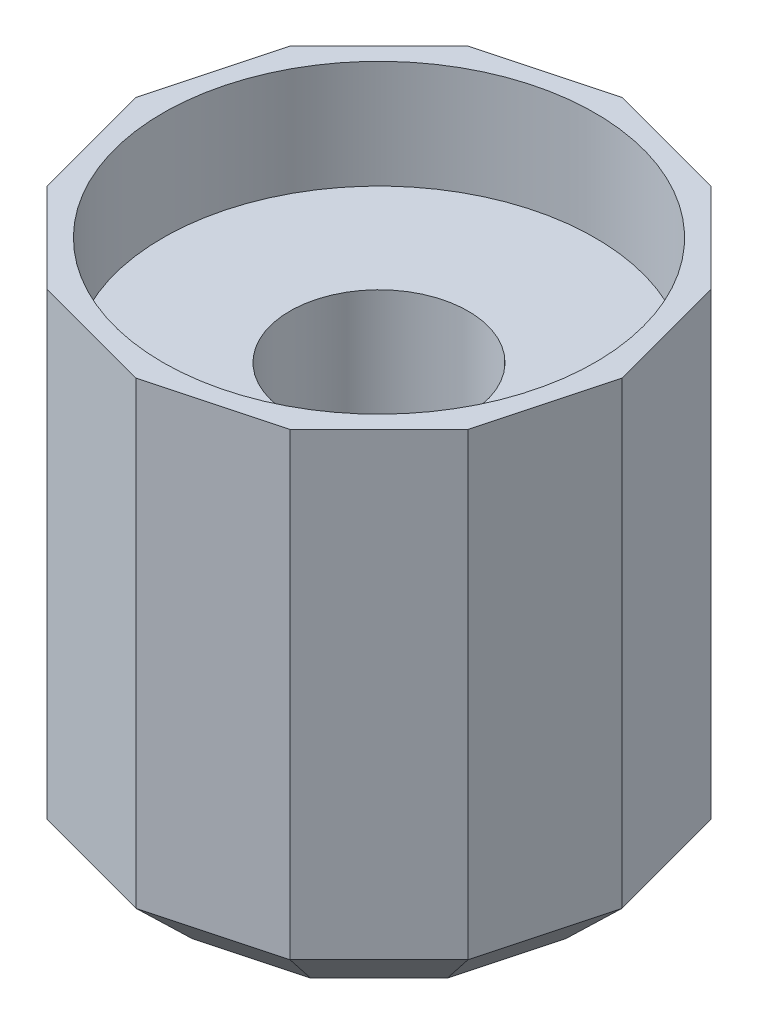
ISO-10303-21;
HEADER;
FILE_DESCRIPTION(('STEP AP214'),'2;1');
FILE_NAME('part.step','',(''),(''),'','','');
FILE_SCHEMA(('AUTOMOTIVE_DESIGN { 1 0 10303 214 1 1 1 1 }'));
ENDSEC;
DATA;
#1=APPLICATION_CONTEXT('core data for automotive mechanical design processes');
#2=APPLICATION_PROTOCOL_DEFINITION('international standard','automotive_design',2000,#1);
#3=PRODUCT_CONTEXT('',#1,'mechanical');
#4=PRODUCT('Part','Part','',(#3));
#5=PRODUCT_RELATED_PRODUCT_CATEGORY('part','',(#4));
#6=PRODUCT_DEFINITION_FORMATION('','',#4);
#7=PRODUCT_DEFINITION_CONTEXT('part definition',#1,'design');
#8=PRODUCT_DEFINITION('design','',#6,#7);
#9=PRODUCT_DEFINITION_SHAPE('','',#8);
#10=(LENGTH_UNIT() NAMED_UNIT(*) SI_UNIT(.MILLI.,.METRE.));
#11=(NAMED_UNIT(*) PLANE_ANGLE_UNIT() SI_UNIT($,.RADIAN.));
#12=(NAMED_UNIT(*) SI_UNIT($,.STERADIAN.) SOLID_ANGLE_UNIT());
#13=UNCERTAINTY_MEASURE_WITH_UNIT(LENGTH_MEASURE(1.E-05),#10,'distance_accuracy_value','');
#14=(GEOMETRIC_REPRESENTATION_CONTEXT(3) GLOBAL_UNCERTAINTY_ASSIGNED_CONTEXT((#13)) GLOBAL_UNIT_ASSIGNED_CONTEXT((#10,
#11,#12)) REPRESENTATION_CONTEXT('',''));
#15=CARTESIAN_POINT('',(0.,0.,0.));
#16=DIRECTION('',(0.,0.,1.));
#17=DIRECTION('',(1.,0.,0.));
#18=AXIS2_PLACEMENT_3D('',#15,#16,#17);
#19=CARTESIAN_POINT('',(4.49999999999993,19.,-7.79422863406));
#20=DIRECTION('',(-0.25881904510251,0.,0.965925826289071));
#21=DIRECTION('',(0.965925826289071,0.,0.25881904510251));
#22=AXIS2_PLACEMENT_3D('',#19,#20,#21);
#23=PLANE('',#22);
#24=DIRECTION('',(0.,-1.,0.));
#25=VECTOR('',#24,1.);
#26=CARTESIAN_POINT('',(4.49999999999993,19.,-7.79422863406));
#27=LINE('',#26,#25);
#28=CARTESIAN_POINT('',(4.49999999999993,19.,-7.79422863406));
#29=VERTEX_POINT('',#28);
#30=CARTESIAN_POINT('',(4.49999999999993,2.00000000000001,-7.79422863406));
#31=VERTEX_POINT('',#30);
#32=EDGE_CURVE('E372',#29,#31,#27,.T.);
#33=ORIENTED_EDGE('',*,*,#32,.T.);
#34=DIRECTION('',(-0.965925826289071,0.,-0.25881904510251));
#35=VECTOR('',#34,1.);
#36=CARTESIAN_POINT('',(4.49999999999993,2.00000000000001,-7.79422863406));
#37=LINE('',#36,#35);
#38=CARTESIAN_POINT('',(-1.01481323344643E-13,2.00000000000001,-9.));
#39=VERTEX_POINT('',#38);
#40=EDGE_CURVE('E201',#31,#39,#37,.T.);
#41=ORIENTED_EDGE('',*,*,#40,.T.);
#42=DIRECTION('',(0.,-1.,0.));
#43=VECTOR('',#42,1.);
#44=CARTESIAN_POINT('',(-1.01481323344643E-13,19.,-9.));
#45=LINE('',#44,#43);
#46=CARTESIAN_POINT('',(-1.01481323344643E-13,19.,-9.));
#47=VERTEX_POINT('',#46);
#48=EDGE_CURVE('E181',#47,#39,#45,.T.);
#49=ORIENTED_EDGE('',*,*,#48,.F.);
#50=DIRECTION('',(-0.965925826289071,0.,-0.25881904510251));
#51=VECTOR('',#50,1.);
#52=CARTESIAN_POINT('',(4.49999999999993,19.,-7.79422863406));
#53=LINE('',#52,#51);
#54=EDGE_CURVE('E188',#29,#47,#53,.T.);
#55=ORIENTED_EDGE('',*,*,#54,.F.);
#56=EDGE_LOOP('',(#33,#41,#49,#55));
#57=FACE_BOUND('',#56,.T.);
#58=ADVANCED_FACE('F47',(#57),#23,.F.);
#59=CARTESIAN_POINT('',(-1.01481323344643E-13,19.,-9.));
#60=DIRECTION('',(0.25881904510253,0.,0.965925826289066));
#61=DIRECTION('',(0.965925826289066,0.,-0.25881904510253));
#62=AXIS2_PLACEMENT_3D('',#59,#60,#61);
#63=PLANE('',#62);
#64=ORIENTED_EDGE('',*,*,#48,.T.);
#65=DIRECTION('',(-0.965925826289066,0.,0.25881904510253));
#66=VECTOR('',#65,1.);
#67=CARTESIAN_POINT('',(-1.01481323344643E-13,2.00000000000001,-9.));
#68=LINE('',#67,#66);
#69=CARTESIAN_POINT('',(-4.50000000000008,2.00000000000001,-7.79422863405991));
#70=VERTEX_POINT('',#69);
#71=EDGE_CURVE('E270',#39,#70,#68,.T.);
#72=ORIENTED_EDGE('',*,*,#71,.T.);
#73=DIRECTION('',(0.,-1.,0.));
#74=VECTOR('',#73,1.);
#75=CARTESIAN_POINT('',(-4.50000000000008,19.,-7.79422863405991));
#76=LINE('',#75,#74);
#77=CARTESIAN_POINT('',(-4.50000000000008,19.,-7.79422863405991));
#78=VERTEX_POINT('',#77);
#79=EDGE_CURVE('E183',#78,#70,#76,.T.);
#80=ORIENTED_EDGE('',*,*,#79,.F.);
#81=DIRECTION('',(-0.965925826289066,0.,0.25881904510253));
#82=VECTOR('',#81,1.);
#83=CARTESIAN_POINT('',(-1.01481323344643E-13,19.,-9.));
#84=LINE('',#83,#82);
#85=EDGE_CURVE('E177',#47,#78,#84,.T.);
#86=ORIENTED_EDGE('',*,*,#85,.F.);
#87=EDGE_LOOP('',(#64,#72,#80,#86));
#88=FACE_BOUND('',#87,.T.);
#89=ADVANCED_FACE('F179',(#88),#63,.F.);
#90=CARTESIAN_POINT('',(-4.50000000000008,19.,-7.79422863405991));
#91=DIRECTION('',(0.707106781186555,0.,0.70710678118654));
#92=DIRECTION('',(0.70710678118654,0.,-0.707106781186555));
#93=AXIS2_PLACEMENT_3D('',#90,#91,#92);
#94=PLANE('',#93);
#95=ORIENTED_EDGE('',*,*,#79,.T.);
#96=DIRECTION('',(-0.70710678118654,0.,0.707106781186555));
#97=VECTOR('',#96,1.);
#98=CARTESIAN_POINT('',(-4.50000000000008,2.00000000000001,-7.79422863405991));
#99=LINE('',#98,#97);
#100=CARTESIAN_POINT('',(-7.79422863406,2.00000000000001,-4.49999999999992));
#101=VERTEX_POINT('',#100);
#102=EDGE_CURVE('E73',#70,#101,#99,.T.);
#103=ORIENTED_EDGE('',*,*,#102,.T.);
#104=DIRECTION('',(0.,-1.,0.));
#105=VECTOR('',#104,1.);
#106=CARTESIAN_POINT('',(-7.79422863406,19.,-4.49999999999992));
#107=LINE('',#106,#105);
#108=CARTESIAN_POINT('',(-7.79422863406,19.,-4.49999999999992));
#109=VERTEX_POINT('',#108);
#110=EDGE_CURVE('E210',#109,#101,#107,.T.);
#111=ORIENTED_EDGE('',*,*,#110,.F.);
#112=DIRECTION('',(-0.70710678118654,0.,0.707106781186555));
#113=VECTOR('',#112,1.);
#114=CARTESIAN_POINT('',(-4.50000000000008,19.,-7.79422863405991));
#115=LINE('',#114,#113);
#116=EDGE_CURVE('E187',#78,#109,#115,.T.);
#117=ORIENTED_EDGE('',*,*,#116,.F.);
#118=EDGE_LOOP('',(#95,#103,#111,#117));
#119=FACE_BOUND('',#118,.T.);
#120=ADVANCED_FACE('F432',(#119),#94,.F.);
#121=CARTESIAN_POINT('',(-7.79422863406,19.,-4.49999999999992));
#122=DIRECTION('',(0.965925826289071,0.,0.258819045102509));
#123=DIRECTION('',(0.258819045102509,0.,-0.965925826289071));
#124=AXIS2_PLACEMENT_3D('',#121,#122,#123);
#125=PLANE('',#124);
#126=ORIENTED_EDGE('',*,*,#110,.T.);
#127=DIRECTION('',(-0.258819045102509,0.,0.965925826289071));
#128=VECTOR('',#127,1.);
#129=CARTESIAN_POINT('',(-7.79422863406,2.00000000000001,-4.49999999999992));
#130=LINE('',#129,#128);
#131=CARTESIAN_POINT('',(-9.,2.00000000000001,1.0321604682062E-13));
#132=VERTEX_POINT('',#131);
#133=EDGE_CURVE('E58',#101,#132,#130,.T.);
#134=ORIENTED_EDGE('',*,*,#133,.T.);
#135=DIRECTION('',(0.,-1.,0.));
#136=VECTOR('',#135,1.);
#137=CARTESIAN_POINT('',(-9.,19.,1.0321604682062E-13));
#138=LINE('',#137,#136);
#139=CARTESIAN_POINT('',(-9.,19.,1.0321604682062E-13));
#140=VERTEX_POINT('',#139);
#141=EDGE_CURVE('E403',#140,#132,#138,.T.);
#142=ORIENTED_EDGE('',*,*,#141,.F.);
#143=DIRECTION('',(-0.258819045102509,0.,0.965925826289071));
#144=VECTOR('',#143,1.);
#145=CARTESIAN_POINT('',(-7.79422863406,19.,-4.49999999999992));
#146=LINE('',#145,#144);
#147=EDGE_CURVE('E346',#109,#140,#146,.T.);
#148=ORIENTED_EDGE('',*,*,#147,.F.);
#149=EDGE_LOOP('',(#126,#134,#142,#148));
#150=FACE_BOUND('',#149,.T.);
#151=ADVANCED_FACE('F408',(#150),#125,.F.);
#152=CARTESIAN_POINT('',(-9.,19.,1.0321604682062E-13));
#153=DIRECTION('',(0.965925826289066,0.,-0.25881904510253));
#154=DIRECTION('',(-0.25881904510253,0.,-0.965925826289066));
#155=AXIS2_PLACEMENT_3D('',#152,#153,#154);
#156=PLANE('',#155);
#157=ORIENTED_EDGE('',*,*,#141,.T.);
#158=DIRECTION('',(0.25881904510253,0.,0.965925826289066));
#159=VECTOR('',#158,1.);
#160=CARTESIAN_POINT('',(-9.,2.00000000000001,1.0321604682062E-13));
#161=LINE('',#160,#159);
#162=CARTESIAN_POINT('',(-7.7942286340599,2.00000000000001,4.50000000000008));
#163=VERTEX_POINT('',#162);
#164=EDGE_CURVE('E11',#132,#163,#161,.T.);
#165=ORIENTED_EDGE('',*,*,#164,.T.);
#166=DIRECTION('',(0.,-1.,0.));
#167=VECTOR('',#166,1.);
#168=CARTESIAN_POINT('',(-7.7942286340599,19.,4.50000000000008));
#169=LINE('',#168,#167);
#170=CARTESIAN_POINT('',(-7.7942286340599,19.,4.50000000000008));
#171=VERTEX_POINT('',#170);
#172=EDGE_CURVE('E399',#171,#163,#169,.T.);
#173=ORIENTED_EDGE('',*,*,#172,.F.);
#174=DIRECTION('',(0.25881904510253,0.,0.965925826289066));
#175=VECTOR('',#174,1.);
#176=CARTESIAN_POINT('',(-9.,19.,1.0321604682062E-13));
#177=LINE('',#176,#175);
#178=EDGE_CURVE('E349',#140,#171,#177,.T.);
#179=ORIENTED_EDGE('',*,*,#178,.F.);
#180=EDGE_LOOP('',(#157,#165,#173,#179));
#181=FACE_BOUND('',#180,.T.);
#182=ADVANCED_FACE('F424',(#181),#156,.F.);
#183=CARTESIAN_POINT('',(-7.7942286340599,19.,4.50000000000008));
#184=DIRECTION('',(0.70710678118654,0.,-0.707106781186555));
#185=DIRECTION('',(-0.707106781186555,0.,-0.70710678118654));
#186=AXIS2_PLACEMENT_3D('',#183,#184,#185);
#187=PLANE('',#186);
#188=ORIENTED_EDGE('',*,*,#172,.T.);
#189=DIRECTION('',(0.707106781186555,0.,0.70710678118654));
#190=VECTOR('',#189,1.);
#191=CARTESIAN_POINT('',(-7.7942286340599,2.00000000000001,4.50000000000008));
#192=LINE('',#191,#190);
#193=CARTESIAN_POINT('',(-4.49999999999992,2.00000000000001,7.79422863406));
#194=VERTEX_POINT('',#193);
#195=EDGE_CURVE('E203',#163,#194,#192,.T.);
#196=ORIENTED_EDGE('',*,*,#195,.T.);
#197=DIRECTION('',(0.,-1.,0.));
#198=VECTOR('',#197,1.);
#199=CARTESIAN_POINT('',(-4.49999999999992,19.,7.79422863406));
#200=LINE('',#199,#198);
#201=CARTESIAN_POINT('',(-4.49999999999992,19.,7.79422863406));
#202=VERTEX_POINT('',#201);
#203=EDGE_CURVE('E395',#202,#194,#200,.T.);
#204=ORIENTED_EDGE('',*,*,#203,.F.);
#205=DIRECTION('',(0.707106781186555,0.,0.70710678118654));
#206=VECTOR('',#205,1.);
#207=CARTESIAN_POINT('',(-7.7942286340599,19.,4.50000000000008));
#208=LINE('',#207,#206);
#209=EDGE_CURVE('E352',#171,#202,#208,.T.);
#210=ORIENTED_EDGE('',*,*,#209,.F.);
#211=EDGE_LOOP('',(#188,#196,#204,#210));
#212=FACE_BOUND('',#211,.T.);
#213=ADVANCED_FACE('F428',(#212),#187,.F.);
#214=CARTESIAN_POINT('',(-4.49999999999992,19.,7.79422863406));
#215=DIRECTION('',(0.25881904510251,0.,-0.965925826289071));
#216=DIRECTION('',(-0.965925826289071,0.,-0.25881904510251));
#217=AXIS2_PLACEMENT_3D('',#214,#215,#216);
#218=PLANE('',#217);
#219=ORIENTED_EDGE('',*,*,#203,.T.);
#220=DIRECTION('',(0.965925826289071,0.,0.25881904510251));
#221=VECTOR('',#220,1.);
#222=CARTESIAN_POINT('',(-4.49999999999992,2.00000000000001,7.79422863406));
#223=LINE('',#222,#221);
#224=CARTESIAN_POINT('',(0.,2.00000000000001,9.));
#225=VERTEX_POINT('',#224);
#226=EDGE_CURVE('E250',#194,#225,#223,.T.);
#227=ORIENTED_EDGE('',*,*,#226,.T.);
#228=DIRECTION('',(0.,-1.,0.));
#229=VECTOR('',#228,1.);
#230=CARTESIAN_POINT('',(0.,19.,9.));
#231=LINE('',#230,#229);
#232=CARTESIAN_POINT('',(0.,19.,9.));
#233=VERTEX_POINT('',#232);
#234=EDGE_CURVE('E391',#233,#225,#231,.T.);
#235=ORIENTED_EDGE('',*,*,#234,.F.);
#236=DIRECTION('',(0.965925826289071,0.,0.25881904510251));
#237=VECTOR('',#236,1.);
#238=CARTESIAN_POINT('',(-4.49999999999992,19.,7.79422863406));
#239=LINE('',#238,#237);
#240=EDGE_CURVE('E355',#202,#233,#239,.T.);
#241=ORIENTED_EDGE('',*,*,#240,.F.);
#242=EDGE_LOOP('',(#219,#227,#235,#241));
#243=FACE_BOUND('',#242,.T.);
#244=ADVANCED_FACE('F682',(#243),#218,.F.);
#245=CARTESIAN_POINT('',(0.,19.,9.));
#246=DIRECTION('',(-0.25881904510253,0.,-0.965925826289066));
#247=DIRECTION('',(-0.965925826289066,0.,0.25881904510253));
#248=AXIS2_PLACEMENT_3D('',#245,#246,#247);
#249=PLANE('',#248);
#250=ORIENTED_EDGE('',*,*,#234,.T.);
#251=DIRECTION('',(0.965925826289066,0.,-0.25881904510253));
#252=VECTOR('',#251,1.);
#253=CARTESIAN_POINT('',(0.,2.00000000000001,9.));
#254=LINE('',#253,#252);
#255=CARTESIAN_POINT('',(4.50000000000008,2.00000000000001,7.7942286340599));
#256=VERTEX_POINT('',#255);
#257=EDGE_CURVE('E253',#225,#256,#254,.T.);
#258=ORIENTED_EDGE('',*,*,#257,.T.);
#259=DIRECTION('',(0.,-1.,0.));
#260=VECTOR('',#259,1.);
#261=CARTESIAN_POINT('',(4.50000000000008,19.,7.7942286340599));
#262=LINE('',#261,#260);
#263=CARTESIAN_POINT('',(4.50000000000008,19.,7.7942286340599));
#264=VERTEX_POINT('',#263);
#265=EDGE_CURVE('E387',#264,#256,#262,.T.);
#266=ORIENTED_EDGE('',*,*,#265,.F.);
#267=DIRECTION('',(0.965925826289066,0.,-0.25881904510253));
#268=VECTOR('',#267,1.);
#269=CARTESIAN_POINT('',(0.,19.,9.));
#270=LINE('',#269,#268);
#271=EDGE_CURVE('E358',#233,#264,#270,.T.);
#272=ORIENTED_EDGE('',*,*,#271,.F.);
#273=EDGE_LOOP('',(#250,#258,#266,#272));
#274=FACE_BOUND('',#273,.T.);
#275=ADVANCED_FACE('F673',(#274),#249,.F.);
#276=CARTESIAN_POINT('',(4.50000000000008,19.,7.7942286340599));
#277=DIRECTION('',(-0.707106781186555,0.,-0.70710678118654));
#278=DIRECTION('',(-0.70710678118654,0.,0.707106781186555));
#279=AXIS2_PLACEMENT_3D('',#276,#277,#278);
#280=PLANE('',#279);
#281=ORIENTED_EDGE('',*,*,#265,.T.);
#282=DIRECTION('',(0.70710678118654,0.,-0.707106781186555));
#283=VECTOR('',#282,1.);
#284=CARTESIAN_POINT('',(4.50000000000008,2.00000000000001,7.7942286340599));
#285=LINE('',#284,#283);
#286=CARTESIAN_POINT('',(7.79422863406,2.00000000000001,4.49999999999992));
#287=VERTEX_POINT('',#286);
#288=EDGE_CURVE('E256',#256,#287,#285,.T.);
#289=ORIENTED_EDGE('',*,*,#288,.T.);
#290=DIRECTION('',(0.,-1.,0.));
#291=VECTOR('',#290,1.);
#292=CARTESIAN_POINT('',(7.79422863406,19.,4.49999999999992));
#293=LINE('',#292,#291);
#294=CARTESIAN_POINT('',(7.79422863406,19.,4.49999999999992));
#295=VERTEX_POINT('',#294);
#296=EDGE_CURVE('E383',#295,#287,#293,.T.);
#297=ORIENTED_EDGE('',*,*,#296,.F.);
#298=DIRECTION('',(0.70710678118654,0.,-0.707106781186555));
#299=VECTOR('',#298,1.);
#300=CARTESIAN_POINT('',(4.50000000000008,19.,7.7942286340599));
#301=LINE('',#300,#299);
#302=EDGE_CURVE('E361',#264,#295,#301,.T.);
#303=ORIENTED_EDGE('',*,*,#302,.F.);
#304=EDGE_LOOP('',(#281,#289,#297,#303));
#305=FACE_BOUND('',#304,.T.);
#306=ADVANCED_FACE('F664',(#305),#280,.F.);
#307=CARTESIAN_POINT('',(7.79422863406,19.,4.49999999999992));
#308=DIRECTION('',(-0.965925826289071,0.,-0.25881904510251));
#309=DIRECTION('',(-0.25881904510251,0.,0.965925826289071));
#310=AXIS2_PLACEMENT_3D('',#307,#308,#309);
#311=PLANE('',#310);
#312=ORIENTED_EDGE('',*,*,#296,.T.);
#313=DIRECTION('',(0.25881904510251,0.,-0.965925826289071));
#314=VECTOR('',#313,1.);
#315=CARTESIAN_POINT('',(7.79422863406,2.00000000000001,4.49999999999992));
#316=LINE('',#315,#314);
#317=CARTESIAN_POINT('',(9.,2.00000000000001,0.));
#318=VERTEX_POINT('',#317);
#319=EDGE_CURVE('E259',#287,#318,#316,.T.);
#320=ORIENTED_EDGE('',*,*,#319,.T.);
#321=DIRECTION('',(0.,-1.,0.));
#322=VECTOR('',#321,1.);
#323=CARTESIAN_POINT('',(9.,19.,0.));
#324=LINE('',#323,#322);
#325=CARTESIAN_POINT('',(9.,19.,0.));
#326=VERTEX_POINT('',#325);
#327=EDGE_CURVE('E379',#326,#318,#324,.T.);
#328=ORIENTED_EDGE('',*,*,#327,.F.);
#329=DIRECTION('',(0.25881904510251,0.,-0.965925826289071));
#330=VECTOR('',#329,1.);
#331=CARTESIAN_POINT('',(7.79422863406,19.,4.49999999999992));
#332=LINE('',#331,#330);
#333=EDGE_CURVE('E364',#295,#326,#332,.T.);
#334=ORIENTED_EDGE('',*,*,#333,.F.);
#335=EDGE_LOOP('',(#312,#320,#328,#334));
#336=FACE_BOUND('',#335,.T.);
#337=ADVANCED_FACE('F655',(#336),#311,.F.);
#338=CARTESIAN_POINT('',(9.,19.,0.));
#339=DIRECTION('',(-0.965925826289066,0.,0.258819045102529));
#340=DIRECTION('',(0.258819045102529,0.,0.965925826289066));
#341=AXIS2_PLACEMENT_3D('',#338,#339,#340);
#342=PLANE('',#341);
#343=ORIENTED_EDGE('',*,*,#327,.T.);
#344=DIRECTION('',(-0.258819045102529,0.,-0.965925826289066));
#345=VECTOR('',#344,1.);
#346=CARTESIAN_POINT('',(9.,2.00000000000001,0.));
#347=LINE('',#346,#345);
#348=CARTESIAN_POINT('',(7.79422863405991,2.00000000000001,-4.50000000000008));
#349=VERTEX_POINT('',#348);
#350=EDGE_CURVE('E262',#318,#349,#347,.T.);
#351=ORIENTED_EDGE('',*,*,#350,.T.);
#352=DIRECTION('',(0.,-1.,0.));
#353=VECTOR('',#352,1.);
#354=CARTESIAN_POINT('',(7.79422863405991,19.,-4.50000000000008));
#355=LINE('',#354,#353);
#356=CARTESIAN_POINT('',(7.79422863405991,19.,-4.50000000000008));
#357=VERTEX_POINT('',#356);
#358=EDGE_CURVE('E375',#357,#349,#355,.T.);
#359=ORIENTED_EDGE('',*,*,#358,.F.);
#360=DIRECTION('',(-0.258819045102529,0.,-0.965925826289066));
#361=VECTOR('',#360,1.);
#362=CARTESIAN_POINT('',(9.,19.,0.));
#363=LINE('',#362,#361);
#364=EDGE_CURVE('E367',#326,#357,#363,.T.);
#365=ORIENTED_EDGE('',*,*,#364,.F.);
#366=EDGE_LOOP('',(#343,#351,#359,#365));
#367=FACE_BOUND('',#366,.T.);
#368=ADVANCED_FACE('F646',(#367),#342,.F.);
#369=CARTESIAN_POINT('',(7.79422863405991,19.,-4.50000000000008));
#370=DIRECTION('',(-0.707106781186541,0.,0.707106781186555));
#371=DIRECTION('',(0.707106781186555,0.,0.707106781186541));
#372=AXIS2_PLACEMENT_3D('',#369,#370,#371);
#373=PLANE('',#372);
#374=ORIENTED_EDGE('',*,*,#358,.T.);
#375=DIRECTION('',(-0.707106781186555,0.,-0.707106781186541));
#376=VECTOR('',#375,1.);
#377=CARTESIAN_POINT('',(7.79422863405991,2.00000000000001,-4.50000000000008));
#378=LINE('',#377,#376);
#379=EDGE_CURVE('E265',#349,#31,#378,.T.);
#380=ORIENTED_EDGE('',*,*,#379,.T.);
#381=ORIENTED_EDGE('',*,*,#32,.F.);
#382=DIRECTION('',(-0.707106781186554,0.,-0.70710678118654));
#383=VECTOR('',#382,1.);
#384=CARTESIAN_POINT('',(7.79422863405991,19.,-4.50000000000008));
#385=LINE('',#384,#383);
#386=EDGE_CURVE('E193',#357,#29,#385,.T.);
#387=ORIENTED_EDGE('',*,*,#386,.F.);
#388=EDGE_LOOP('',(#374,#380,#381,#387));
#389=FACE_BOUND('',#388,.T.);
#390=ADVANCED_FACE('F637',(#389),#373,.F.);
#391=CARTESIAN_POINT('',(0.,19.,0.));
#392=DIRECTION('',(0.,1.,0.));
#393=DIRECTION('',(0.,0.,1.));
#394=AXIS2_PLACEMENT_3D('',#391,#392,#393);
#395=PLANE('',#394);
#396=CARTESIAN_POINT('',(0.,19.,0.));
#397=DIRECTION('',(0.,1.,0.));
#398=DIRECTION('',(0.,0.,1.));
#399=AXIS2_PLACEMENT_3D('',#396,#397,#398);
#400=CIRCLE('',#399,8.);
#401=CARTESIAN_POINT('',(0.,19.,8.));
#402=VERTEX_POINT('',#401);
#403=EDGE_CURVE('E335',#402,#402,#400,.T.);
#404=ORIENTED_EDGE('',*,*,#403,.F.);
#405=EDGE_LOOP('',(#404));
#406=FACE_BOUND('',#405,.T.);
#407=ORIENTED_EDGE('',*,*,#54,.T.);
#408=ORIENTED_EDGE('',*,*,#85,.T.);
#409=ORIENTED_EDGE('',*,*,#116,.T.);
#410=ORIENTED_EDGE('',*,*,#147,.T.);
#411=ORIENTED_EDGE('',*,*,#178,.T.);
#412=ORIENTED_EDGE('',*,*,#209,.T.);
#413=ORIENTED_EDGE('',*,*,#240,.T.);
#414=ORIENTED_EDGE('',*,*,#271,.T.);
#415=ORIENTED_EDGE('',*,*,#302,.T.);
#416=ORIENTED_EDGE('',*,*,#333,.T.);
#417=ORIENTED_EDGE('',*,*,#364,.T.);
#418=ORIENTED_EDGE('',*,*,#386,.T.);
#419=EDGE_LOOP('',(#407,#408,#409,#410,#411,#412,#413,#414,#415,#416,#417,#418));
#420=FACE_BOUND('',#419,.T.);
#421=ADVANCED_FACE('F191',(#406,#420),#395,.T.);
#422=CARTESIAN_POINT('',(0.,0.,0.));
#423=DIRECTION('',(0.,1.,0.));
#424=DIRECTION('',(0.,0.,1.));
#425=AXIS2_PLACEMENT_3D('',#422,#423,#424);
#426=PLANE('',#425);
#427=DIRECTION('',(-0.965925826289071,0.,-0.25881904510251));
#428=VECTOR('',#427,1.);
#429=CARTESIAN_POINT('',(-1.73236190979488,0.,6.46526266445185));
#430=LINE('',#429,#428);
#431=CARTESIAN_POINT('',(0.,0.,6.92944763917982));
#432=VERTEX_POINT('',#431);
#433=CARTESIAN_POINT('',(-3.46472381958985,0.,6.00107768972387));
#434=VERTEX_POINT('',#433);
#435=EDGE_CURVE('E243',#432,#434,#430,.T.);
#436=ORIENTED_EDGE('',*,*,#435,.T.);
#437=DIRECTION('',(-0.707106781186555,0.,-0.70710678118654));
#438=VECTOR('',#437,1.);
#439=CARTESIAN_POINT('',(-4.73290075465682,0.,4.73290075465692));
#440=LINE('',#439,#438);
#441=CARTESIAN_POINT('',(-6.0010776897238,0.,3.46472381958997));
#442=VERTEX_POINT('',#441);
#443=EDGE_CURVE('E246',#434,#442,#440,.T.);
#444=ORIENTED_EDGE('',*,*,#443,.T.);
#445=DIRECTION('',(-0.25881904510253,0.,-0.965925826289066));
#446=VECTOR('',#445,1.);
#447=CARTESIAN_POINT('',(-6.46526266445181,0.,1.73236190979502));
#448=LINE('',#447,#446);
#449=CARTESIAN_POINT('',(-6.92944763917982,0.,0.));
#450=VERTEX_POINT('',#449);
#451=EDGE_CURVE('E208',#442,#450,#448,.T.);
#452=ORIENTED_EDGE('',*,*,#451,.T.);
#453=DIRECTION('',(0.258819045102509,0.,-0.965925826289071));
#454=VECTOR('',#453,1.);
#455=CARTESIAN_POINT('',(-6.46526266445184,0.,-1.73236190979488));
#456=LINE('',#455,#454);
#457=CARTESIAN_POINT('',(-6.00107768972386,0.,-3.46472381958985));
#458=VERTEX_POINT('',#457);
#459=EDGE_CURVE('E216',#450,#458,#456,.T.);
#460=ORIENTED_EDGE('',*,*,#459,.T.);
#461=DIRECTION('',(0.70710678118654,0.,-0.707106781186555));
#462=VECTOR('',#461,1.);
#463=CARTESIAN_POINT('',(-4.73290075465692,0.,-4.73290075465682));
#464=LINE('',#463,#462);
#465=CARTESIAN_POINT('',(-3.46472381958997,0.,-6.0010776897238));
#466=VERTEX_POINT('',#465);
#467=EDGE_CURVE('E219',#458,#466,#464,.T.);
#468=ORIENTED_EDGE('',*,*,#467,.T.);
#469=DIRECTION('',(0.965925826289066,0.,-0.25881904510253));
#470=VECTOR('',#469,1.);
#471=CARTESIAN_POINT('',(-1.73236190979502,0.,-6.46526266445181));
#472=LINE('',#471,#470);
#473=CARTESIAN_POINT('',(0.,0.,-6.92944763917982));
#474=VERTEX_POINT('',#473);
#475=EDGE_CURVE('E222',#466,#474,#472,.T.);
#476=ORIENTED_EDGE('',*,*,#475,.T.);
#477=DIRECTION('',(0.965925826289071,0.,0.25881904510251));
#478=VECTOR('',#477,1.);
#479=CARTESIAN_POINT('',(1.73236190979488,0.,-6.46526266445184));
#480=LINE('',#479,#478);
#481=CARTESIAN_POINT('',(3.46472381958985,0.,-6.00107768972387));
#482=VERTEX_POINT('',#481);
#483=EDGE_CURVE('E225',#474,#482,#480,.T.);
#484=ORIENTED_EDGE('',*,*,#483,.T.);
#485=DIRECTION('',(0.707106781186555,0.,0.707106781186541));
#486=VECTOR('',#485,1.);
#487=CARTESIAN_POINT('',(4.73290075465683,0.,-4.73290075465692));
#488=LINE('',#487,#486);
#489=CARTESIAN_POINT('',(6.0010776897238,0.,-3.46472381958997));
#490=VERTEX_POINT('',#489);
#491=EDGE_CURVE('E228',#482,#490,#488,.T.);
#492=ORIENTED_EDGE('',*,*,#491,.T.);
#493=DIRECTION('',(0.258819045102529,0.,0.965925826289066));
#494=VECTOR('',#493,1.);
#495=CARTESIAN_POINT('',(6.46526266445181,0.,-1.73236190979501));
#496=LINE('',#495,#494);
#497=CARTESIAN_POINT('',(6.92944763917982,0.,0.));
#498=VERTEX_POINT('',#497);
#499=EDGE_CURVE('E231',#490,#498,#496,.T.);
#500=ORIENTED_EDGE('',*,*,#499,.T.);
#501=DIRECTION('',(-0.25881904510251,0.,0.965925826289071));
#502=VECTOR('',#501,1.);
#503=CARTESIAN_POINT('',(6.46526266445184,0.,1.73236190979488));
#504=LINE('',#503,#502);
#505=CARTESIAN_POINT('',(6.00107768972387,0.,3.46472381958985));
#506=VERTEX_POINT('',#505);
#507=EDGE_CURVE('E234',#498,#506,#504,.T.);
#508=ORIENTED_EDGE('',*,*,#507,.T.);
#509=DIRECTION('',(-0.70710678118654,0.,0.707106781186555));
#510=VECTOR('',#509,1.);
#511=CARTESIAN_POINT('',(4.73290075465692,0.,4.73290075465682));
#512=LINE('',#511,#510);
#513=CARTESIAN_POINT('',(3.46472381958997,0.,6.0010776897238));
#514=VERTEX_POINT('',#513);
#515=EDGE_CURVE('E237',#506,#514,#512,.T.);
#516=ORIENTED_EDGE('',*,*,#515,.T.);
#517=DIRECTION('',(-0.965925826289066,0.,0.25881904510253));
#518=VECTOR('',#517,1.);
#519=CARTESIAN_POINT('',(1.73236190979502,0.,6.46526266445181));
#520=LINE('',#519,#518);
#521=EDGE_CURVE('E240',#514,#432,#520,.T.);
#522=ORIENTED_EDGE('',*,*,#521,.T.);
#523=EDGE_LOOP('',(#436,#444,#452,#460,#468,#476,#484,#492,#500,#508,#516,#522));
#524=FACE_BOUND('',#523,.T.);
#525=ADVANCED_FACE('F439',(#524),#426,.F.);
#526=CARTESIAN_POINT('',(0.,15.,0.));
#527=DIRECTION('',(0.,1.,0.));
#528=DIRECTION('',(0.,0.,1.));
#529=AXIS2_PLACEMENT_3D('',#526,#527,#528);
#530=CYLINDRICAL_SURFACE('',#529,8.);
#531=CARTESIAN_POINT('',(0.,15.,0.));
#532=DIRECTION('',(0.,1.,0.));
#533=DIRECTION('',(0.,0.,1.));
#534=AXIS2_PLACEMENT_3D('',#531,#532,#533);
#535=CIRCLE('',#534,8.);
#536=CARTESIAN_POINT('',(0.,15.,8.));
#537=VERTEX_POINT('',#536);
#538=EDGE_CURVE('E198',#537,#537,#535,.T.);
#539=ORIENTED_EDGE('',*,*,#538,.F.);
#540=EDGE_LOOP('',(#539));
#541=FACE_BOUND('',#540,.T.);
#542=ORIENTED_EDGE('',*,*,#403,.T.);
#543=EDGE_LOOP('',(#542));
#544=FACE_BOUND('',#543,.T.);
#545=ADVANCED_FACE('F613',(#541,#544),#530,.F.);
#546=CARTESIAN_POINT('',(0.,15.,0.));
#547=DIRECTION('',(0.,1.,0.));
#548=DIRECTION('',(0.,0.,1.));
#549=AXIS2_PLACEMENT_3D('',#546,#547,#548);
#550=PLANE('',#549);
#551=CARTESIAN_POINT('',(0.,15.,0.));
#552=DIRECTION('',(0.,1.,0.));
#553=DIRECTION('',(0.,0.,1.));
#554=AXIS2_PLACEMENT_3D('',#551,#552,#553);
#555=CIRCLE('',#554,3.3);
#556=CARTESIAN_POINT('',(0.,15.,3.3));
#557=VERTEX_POINT('',#556);
#558=EDGE_CURVE('E323',#557,#557,#555,.T.);
#559=ORIENTED_EDGE('',*,*,#558,.F.);
#560=EDGE_LOOP('',(#559));
#561=FACE_BOUND('',#560,.T.);
#562=ORIENTED_EDGE('',*,*,#538,.T.);
#563=EDGE_LOOP('',(#562));
#564=FACE_BOUND('',#563,.T.);
#565=ADVANCED_FACE('F604',(#561,#564),#550,.T.);
#566=CARTESIAN_POINT('',(0.,0.999999999999999,0.));
#567=DIRECTION('',(0.,1.,0.));
#568=DIRECTION('',(0.,0.,1.));
#569=AXIS2_PLACEMENT_3D('',#566,#567,#568);
#570=CYLINDRICAL_SURFACE('',#569,3.3);
#571=CARTESIAN_POINT('',(0.,0.999999999999999,0.));
#572=DIRECTION('',(0.,1.,0.));
#573=DIRECTION('',(0.,0.,1.));
#574=AXIS2_PLACEMENT_3D('',#571,#572,#573);
#575=CIRCLE('',#574,3.3);
#576=CARTESIAN_POINT('',(0.,0.999999999999999,3.3));
#577=VERTEX_POINT('',#576);
#578=EDGE_CURVE('E329',#577,#577,#575,.T.);
#579=ORIENTED_EDGE('',*,*,#578,.F.);
#580=EDGE_LOOP('',(#579));
#581=FACE_BOUND('',#580,.T.);
#582=ORIENTED_EDGE('',*,*,#558,.T.);
#583=EDGE_LOOP('',(#582));
#584=FACE_BOUND('',#583,.T.);
#585=ADVANCED_FACE('F595',(#581,#584),#570,.F.);
#586=CARTESIAN_POINT('',(0.,0.999999999999999,0.));
#587=DIRECTION('',(0.,1.,0.));
#588=DIRECTION('',(0.,0.,1.));
#589=AXIS2_PLACEMENT_3D('',#586,#587,#588);
#590=PLANE('',#589);
#591=ORIENTED_EDGE('',*,*,#578,.T.);
#592=EDGE_LOOP('',(#591));
#593=FACE_BOUND('',#592,.T.);
#594=ADVANCED_FACE('F449',(#593),#590,.T.);
#595=CARTESIAN_POINT('',(7.79422863405991,2.00000000000001,-4.50000000000008));
#596=DIRECTION('',(-0.499999999999994,0.707106781186549,0.500000000000004));
#597=DIRECTION('',(-0.707106781186555,0.,-0.707106781186541));
#598=AXIS2_PLACEMENT_3D('',#595,#596,#597);
#599=PLANE('',#598);
#600=DIRECTION('',(-0.622892752510493,-0.694746590606864,0.359627298338209));
#601=VECTOR('',#600,1.);
#602=CARTESIAN_POINT('',(7.79422863405991,2.00000000000001,-4.50000000000008));
#603=LINE('',#602,#601);
#604=EDGE_CURVE('E314',#490,#349,#603,.F.);
#605=ORIENTED_EDGE('',*,*,#604,.F.);
#606=ORIENTED_EDGE('',*,*,#491,.F.);
#607=DIRECTION('',(-0.359627298338196,-0.694746590606864,0.622892752510501));
#608=VECTOR('',#607,1.);
#609=CARTESIAN_POINT('',(4.49999999999993,2.00000000000001,-7.79422863406));
#610=LINE('',#609,#608);
#611=EDGE_CURVE('E52',#31,#482,#610,.T.);
#612=ORIENTED_EDGE('',*,*,#611,.F.);
#613=ORIENTED_EDGE('',*,*,#379,.F.);
#614=EDGE_LOOP('',(#605,#606,#612,#613));
#615=FACE_BOUND('',#614,.T.);
#616=ADVANCED_FACE('F50',(#615),#599,.F.);
#617=CARTESIAN_POINT('',(4.49999999999993,2.00000000000001,-7.79422863406));
#618=DIRECTION('',(-0.183012701892211,0.707106781186549,0.68301270189222));
#619=DIRECTION('',(-0.965925826289071,0.,-0.25881904510251));
#620=AXIS2_PLACEMENT_3D('',#617,#618,#619);
#621=PLANE('',#620);
#622=ORIENTED_EDGE('',*,*,#611,.T.);
#623=ORIENTED_EDGE('',*,*,#483,.F.);
#624=DIRECTION('',(0.,-0.694746590606865,0.719254596676405));
#625=VECTOR('',#624,1.);
#626=CARTESIAN_POINT('',(-1.01777532886734E-13,2.00000000000001,-9.));
#627=LINE('',#626,#625);
#628=EDGE_CURVE('E311',#39,#474,#627,.T.);
#629=ORIENTED_EDGE('',*,*,#628,.F.);
#630=ORIENTED_EDGE('',*,*,#40,.F.);
#631=EDGE_LOOP('',(#622,#623,#629,#630));
#632=FACE_BOUND('',#631,.T.);
#633=ADVANCED_FACE('F441',(#632),#621,.F.);
#634=CARTESIAN_POINT('',(9.,2.00000000000001,0.));
#635=DIRECTION('',(-0.683012701892217,0.707106781186549,0.183012701892225));
#636=DIRECTION('',(-0.258819045102529,0.,-0.965925826289066));
#637=AXIS2_PLACEMENT_3D('',#634,#635,#636);
#638=PLANE('',#637);
#639=ORIENTED_EDGE('',*,*,#604,.T.);
#640=ORIENTED_EDGE('',*,*,#350,.F.);
#641=DIRECTION('',(-0.719254596676405,-0.694746590606865,0.));
#642=VECTOR('',#641,1.);
#643=CARTESIAN_POINT('',(9.,2.00000000000001,0.));
#644=LINE('',#643,#642);
#645=EDGE_CURVE('E307',#498,#318,#644,.F.);
#646=ORIENTED_EDGE('',*,*,#645,.F.);
#647=ORIENTED_EDGE('',*,*,#499,.F.);
#648=EDGE_LOOP('',(#639,#640,#646,#647));
#649=FACE_BOUND('',#648,.T.);
#650=ADVANCED_FACE('F443',(#649),#638,.F.);
#651=CARTESIAN_POINT('',(-1.01481323344643E-13,2.00000000000001,-9.));
#652=DIRECTION('',(0.183012701892226,0.707106781186549,0.683012701892216));
#653=DIRECTION('',(-0.965925826289066,0.,0.25881904510253));
#654=AXIS2_PLACEMENT_3D('',#651,#652,#653);
#655=PLANE('',#654);
#656=ORIENTED_EDGE('',*,*,#628,.T.);
#657=ORIENTED_EDGE('',*,*,#475,.F.);
#658=DIRECTION('',(0.35962729833821,-0.694746590606865,0.622892752510493));
#659=VECTOR('',#658,1.);
#660=CARTESIAN_POINT('',(-4.50000000000008,2.00000000000001,-7.79422863405991));
#661=LINE('',#660,#659);
#662=EDGE_CURVE('E303',#70,#466,#661,.T.);
#663=ORIENTED_EDGE('',*,*,#662,.F.);
#664=ORIENTED_EDGE('',*,*,#71,.F.);
#665=EDGE_LOOP('',(#656,#657,#663,#664));
#666=FACE_BOUND('',#665,.T.);
#667=ADVANCED_FACE('F437',(#666),#655,.F.);
#668=CARTESIAN_POINT('',(7.79422863406,2.00000000000001,4.49999999999992));
#669=DIRECTION('',(-0.68301270189222,0.707106781186549,-0.183012701892211));
#670=DIRECTION('',(0.25881904510251,0.,-0.965925826289071));
#671=AXIS2_PLACEMENT_3D('',#668,#669,#670);
#672=PLANE('',#671);
#673=ORIENTED_EDGE('',*,*,#645,.T.);
#674=ORIENTED_EDGE('',*,*,#319,.F.);
#675=DIRECTION('',(-0.622892752510501,-0.694746590606865,-0.359627298338196));
#676=VECTOR('',#675,1.);
#677=CARTESIAN_POINT('',(7.79422863406,2.00000000000001,4.49999999999992));
#678=LINE('',#677,#676);
#679=EDGE_CURVE('E299',#506,#287,#678,.F.);
#680=ORIENTED_EDGE('',*,*,#679,.F.);
#681=ORIENTED_EDGE('',*,*,#507,.F.);
#682=EDGE_LOOP('',(#673,#674,#680,#681));
#683=FACE_BOUND('',#682,.T.);
#684=ADVANCED_FACE('F505',(#683),#672,.F.);
#685=CARTESIAN_POINT('',(-4.50000000000008,2.00000000000001,-7.79422863405991));
#686=DIRECTION('',(0.500000000000004,0.707106781186549,0.499999999999994));
#687=DIRECTION('',(-0.70710678118654,0.,0.707106781186555));
#688=AXIS2_PLACEMENT_3D('',#685,#686,#687);
#689=PLANE('',#688);
#690=ORIENTED_EDGE('',*,*,#662,.T.);
#691=ORIENTED_EDGE('',*,*,#467,.F.);
#692=DIRECTION('',(0.622892752510501,-0.694746590606864,0.359627298338196));
#693=VECTOR('',#692,1.);
#694=CARTESIAN_POINT('',(-7.79422863406,2.00000000000001,-4.49999999999992));
#695=LINE('',#694,#693);
#696=EDGE_CURVE('E295',#101,#458,#695,.T.);
#697=ORIENTED_EDGE('',*,*,#696,.F.);
#698=ORIENTED_EDGE('',*,*,#102,.F.);
#699=EDGE_LOOP('',(#690,#691,#697,#698));
#700=FACE_BOUND('',#699,.T.);
#701=ADVANCED_FACE('F411',(#700),#689,.F.);
#702=CARTESIAN_POINT('',(4.50000000000008,2.00000000000001,7.7942286340599));
#703=DIRECTION('',(-0.500000000000004,0.707106781186549,-0.499999999999994));
#704=DIRECTION('',(0.70710678118654,0.,-0.707106781186555));
#705=AXIS2_PLACEMENT_3D('',#702,#703,#704);
#706=PLANE('',#705);
#707=ORIENTED_EDGE('',*,*,#679,.T.);
#708=ORIENTED_EDGE('',*,*,#288,.F.);
#709=DIRECTION('',(-0.359627298338209,-0.694746590606865,-0.622892752510493));
#710=VECTOR('',#709,1.);
#711=CARTESIAN_POINT('',(4.50000000000008,2.00000000000001,7.7942286340599));
#712=LINE('',#711,#710);
#713=EDGE_CURVE('E291',#514,#256,#712,.F.);
#714=ORIENTED_EDGE('',*,*,#713,.F.);
#715=ORIENTED_EDGE('',*,*,#515,.F.);
#716=EDGE_LOOP('',(#707,#708,#714,#715));
#717=FACE_BOUND('',#716,.T.);
#718=ADVANCED_FACE('F493',(#717),#706,.F.);
#719=CARTESIAN_POINT('',(-7.79422863406,2.00000000000001,-4.49999999999992));
#720=DIRECTION('',(0.68301270189222,0.707106781186549,0.183012701892211));
#721=DIRECTION('',(-0.258819045102509,0.,0.965925826289071));
#722=AXIS2_PLACEMENT_3D('',#719,#720,#721);
#723=PLANE('',#722);
#724=ORIENTED_EDGE('',*,*,#696,.T.);
#725=ORIENTED_EDGE('',*,*,#459,.F.);
#726=DIRECTION('',(0.719254596676405,-0.694746590606865,0.));
#727=VECTOR('',#726,1.);
#728=CARTESIAN_POINT('',(-9.,2.00000000000001,1.0321604682062E-13));
#729=LINE('',#728,#727);
#730=EDGE_CURVE('E287',#132,#450,#729,.T.);
#731=ORIENTED_EDGE('',*,*,#730,.F.);
#732=ORIENTED_EDGE('',*,*,#133,.F.);
#733=EDGE_LOOP('',(#724,#725,#731,#732));
#734=FACE_BOUND('',#733,.T.);
#735=ADVANCED_FACE('F415',(#734),#723,.F.);
#736=CARTESIAN_POINT('',(0.,2.00000000000001,9.));
#737=DIRECTION('',(-0.183012701892226,0.707106781186549,-0.683012701892216));
#738=DIRECTION('',(0.965925826289066,0.,-0.25881904510253));
#739=AXIS2_PLACEMENT_3D('',#736,#737,#738);
#740=PLANE('',#739);
#741=ORIENTED_EDGE('',*,*,#713,.T.);
#742=ORIENTED_EDGE('',*,*,#257,.F.);
#743=DIRECTION('',(0.,-0.694746590606865,-0.719254596676405));
#744=VECTOR('',#743,1.);
#745=CARTESIAN_POINT('',(0.,2.00000000000001,9.));
#746=LINE('',#745,#744);
#747=EDGE_CURVE('E283',#432,#225,#746,.F.);
#748=ORIENTED_EDGE('',*,*,#747,.F.);
#749=ORIENTED_EDGE('',*,*,#521,.F.);
#750=EDGE_LOOP('',(#741,#742,#748,#749));
#751=FACE_BOUND('',#750,.T.);
#752=ADVANCED_FACE('F481',(#751),#740,.F.);
#753=CARTESIAN_POINT('',(-9.,2.00000000000001,1.0321604682062E-13));
#754=DIRECTION('',(0.683012701892216,0.707106781186549,-0.183012701892226));
#755=DIRECTION('',(0.25881904510253,0.,0.965925826289066));
#756=AXIS2_PLACEMENT_3D('',#753,#754,#755);
#757=PLANE('',#756);
#758=ORIENTED_EDGE('',*,*,#730,.T.);
#759=ORIENTED_EDGE('',*,*,#451,.F.);
#760=DIRECTION('',(-0.622892752510493,0.694746590606864,0.35962729833821));
#761=VECTOR('',#760,1.);
#762=CARTESIAN_POINT('',(-7.25402078491449,1.39747643571031,4.18811085287762));
#763=LINE('',#762,#761);
#764=EDGE_CURVE('E280',#163,#442,#763,.F.);
#765=ORIENTED_EDGE('',*,*,#764,.F.);
#766=ORIENTED_EDGE('',*,*,#164,.F.);
#767=EDGE_LOOP('',(#758,#759,#765,#766));
#768=FACE_BOUND('',#767,.T.);
#769=ADVANCED_FACE('F420',(#768),#757,.F.);
#770=CARTESIAN_POINT('',(-4.49999999999992,2.00000000000001,7.79422863406));
#771=DIRECTION('',(0.183012701892211,0.707106781186549,-0.68301270189222));
#772=DIRECTION('',(0.965925826289071,0.,0.25881904510251));
#773=AXIS2_PLACEMENT_3D('',#770,#771,#772);
#774=PLANE('',#773);
#775=ORIENTED_EDGE('',*,*,#747,.T.);
#776=ORIENTED_EDGE('',*,*,#226,.F.);
#777=DIRECTION('',(0.359627298338198,-0.694746590606864,-0.6228927525105));
#778=VECTOR('',#777,1.);
#779=CARTESIAN_POINT('',(-4.49999999999992,2.00000000000001,7.79422863406));
#780=LINE('',#779,#778);
#781=EDGE_CURVE('E277',#434,#194,#780,.F.);
#782=ORIENTED_EDGE('',*,*,#781,.F.);
#783=ORIENTED_EDGE('',*,*,#435,.F.);
#784=EDGE_LOOP('',(#775,#776,#782,#783));
#785=FACE_BOUND('',#784,.T.);
#786=ADVANCED_FACE('F468',(#785),#774,.F.);
#787=CARTESIAN_POINT('',(-7.7942286340599,2.00000000000001,4.50000000000008));
#788=DIRECTION('',(0.499999999999994,0.707106781186549,-0.500000000000004));
#789=DIRECTION('',(0.707106781186555,0.,0.70710678118654));
#790=AXIS2_PLACEMENT_3D('',#787,#788,#789);
#791=PLANE('',#790);
#792=ORIENTED_EDGE('',*,*,#764,.T.);
#793=ORIENTED_EDGE('',*,*,#443,.F.);
#794=ORIENTED_EDGE('',*,*,#781,.T.);
#795=ORIENTED_EDGE('',*,*,#195,.F.);
#796=EDGE_LOOP('',(#792,#793,#794,#795));
#797=FACE_BOUND('',#796,.T.);
#798=ADVANCED_FACE('F462',(#797),#791,.F.);
#799=CLOSED_SHELL('',(#58,#89,#120,#151,#182,#213,#244,#275,#306,#337,#368,#390,#421,#525,#545,
#565,#585,#594,#616,#633,#650,#667,#684,#701,#718,#735,#752,#769,#786,#798));
#800=MANIFOLD_SOLID_BREP('B2',#799);
#801=ADVANCED_BREP_SHAPE_REPRESENTATION('',(#18,#800),#14);
#802=SHAPE_DEFINITION_REPRESENTATION(#9,#801);
ENDSEC;
END-ISO-10303-21;
